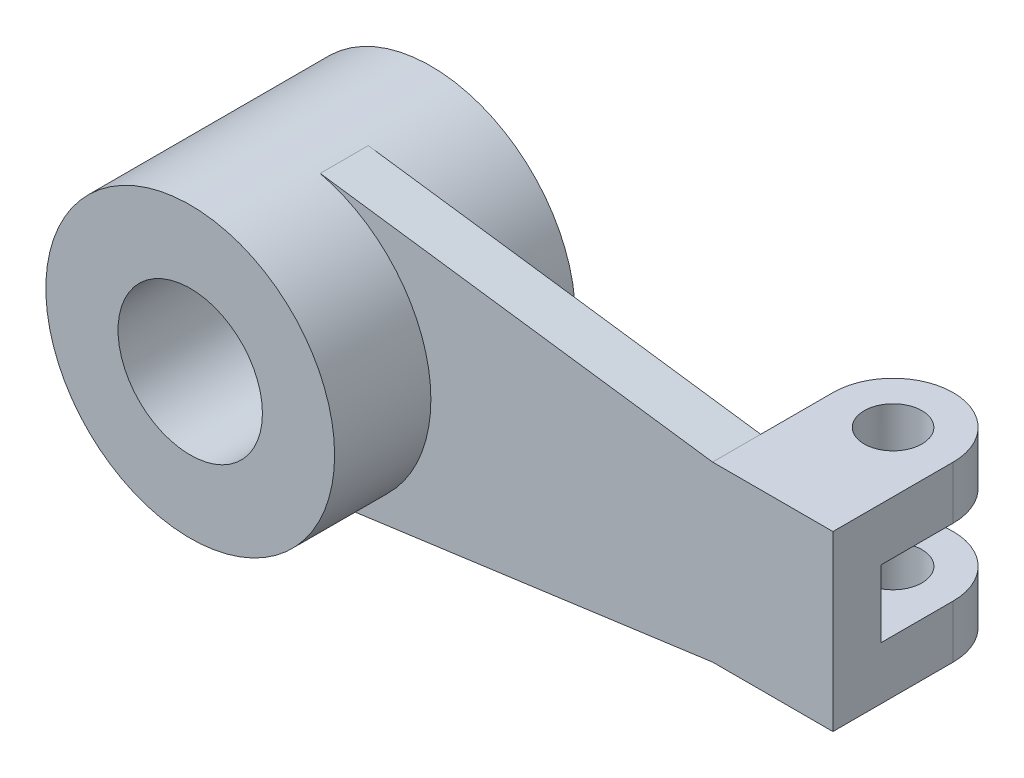
ISO-10303-21;
HEADER;
FILE_DESCRIPTION(('STEP AP214'),'2;1');
FILE_NAME('part.step','',(''),(''),'','','');
FILE_SCHEMA(('AUTOMOTIVE_DESIGN { 1 0 10303 214 1 1 1 1 }'));
ENDSEC;
DATA;
#1=APPLICATION_CONTEXT('core data for automotive mechanical design processes');
#2=APPLICATION_PROTOCOL_DEFINITION('international standard','automotive_design',2000,#1);
#3=PRODUCT_CONTEXT('',#1,'mechanical');
#4=PRODUCT('Part','Part','',(#3));
#5=PRODUCT_RELATED_PRODUCT_CATEGORY('part','',(#4));
#6=PRODUCT_DEFINITION_FORMATION('','',#4);
#7=PRODUCT_DEFINITION_CONTEXT('part definition',#1,'design');
#8=PRODUCT_DEFINITION('design','',#6,#7);
#9=PRODUCT_DEFINITION_SHAPE('','',#8);
#10=(LENGTH_UNIT() NAMED_UNIT(*) SI_UNIT(.MILLI.,.METRE.));
#11=(NAMED_UNIT(*) PLANE_ANGLE_UNIT() SI_UNIT($,.RADIAN.));
#12=(NAMED_UNIT(*) SI_UNIT($,.STERADIAN.) SOLID_ANGLE_UNIT());
#13=UNCERTAINTY_MEASURE_WITH_UNIT(LENGTH_MEASURE(1.E-05),#10,'distance_accuracy_value','');
#14=(GEOMETRIC_REPRESENTATION_CONTEXT(3) GLOBAL_UNCERTAINTY_ASSIGNED_CONTEXT((#13)) GLOBAL_UNIT_ASSIGNED_CONTEXT((#10,
#11,#12)) REPRESENTATION_CONTEXT('',''));
#15=CARTESIAN_POINT('',(0.,0.,0.));
#16=DIRECTION('',(0.,0.,1.));
#17=DIRECTION('',(1.,0.,0.));
#18=AXIS2_PLACEMENT_3D('',#15,#16,#17);
#19=CARTESIAN_POINT('',(113.53373760739,0.,5.));
#20=DIRECTION('',(-1.,0.,0.));
#21=DIRECTION('',(0.,0.,1.));
#22=AXIS2_PLACEMENT_3D('',#19,#20,#21);
#23=PLANE('',#22);
#24=DIRECTION('',(0.,0.,-1.));
#25=VECTOR('',#24,1.);
#26=CARTESIAN_POINT('',(113.53373760739,7.,0.));
#27=LINE('',#26,#25);
#28=CARTESIAN_POINT('',(113.53373760739,7.,-5.));
#29=VERTEX_POINT('',#28);
#30=CARTESIAN_POINT('',(113.53373760739,7.,-20.));
#31=VERTEX_POINT('',#30);
#32=EDGE_CURVE('E125',#29,#31,#27,.T.);
#33=ORIENTED_EDGE('',*,*,#32,.T.);
#34=DIRECTION('',(0.,1.,0.));
#35=VECTOR('',#34,1.);
#36=CARTESIAN_POINT('',(113.53373760739,-18.0000000000001,-20.));
#37=LINE('',#36,#35);
#38=CARTESIAN_POINT('',(113.53373760739,18.,-20.));
#39=VERTEX_POINT('',#38);
#40=EDGE_CURVE('E172',#31,#39,#37,.T.);
#41=ORIENTED_EDGE('',*,*,#40,.T.);
#42=DIRECTION('',(0.,0.,-1.));
#43=VECTOR('',#42,1.);
#44=CARTESIAN_POINT('',(113.53373760739,18.,5.));
#45=LINE('',#44,#43);
#46=CARTESIAN_POINT('',(113.53373760739,18.,5.));
#47=VERTEX_POINT('',#46);
#48=EDGE_CURVE('E210',#47,#39,#45,.T.);
#49=ORIENTED_EDGE('',*,*,#48,.F.);
#50=DIRECTION('',(0.,1.,0.));
#51=VECTOR('',#50,1.);
#52=CARTESIAN_POINT('',(113.53373760739,0.,5.));
#53=LINE('',#52,#51);
#54=CARTESIAN_POINT('',(113.53373760739,-18.,5.));
#55=VERTEX_POINT('',#54);
#56=EDGE_CURVE('E179',#55,#47,#53,.T.);
#57=ORIENTED_EDGE('',*,*,#56,.F.);
#58=DIRECTION('',(0.,0.,-1.));
#59=VECTOR('',#58,1.);
#60=CARTESIAN_POINT('',(113.53373760739,-18.,5.));
#61=LINE('',#60,#59);
#62=CARTESIAN_POINT('',(113.53373760739,-18.0000000000001,-20.));
#63=VERTEX_POINT('',#62);
#64=EDGE_CURVE('E191',#55,#63,#61,.T.);
#65=ORIENTED_EDGE('',*,*,#64,.T.);
#66=CARTESIAN_POINT('',(113.53373760739,-7.,-20.));
#67=VERTEX_POINT('',#66);
#68=EDGE_CURVE('E137',#63,#67,#37,.T.);
#69=ORIENTED_EDGE('',*,*,#68,.T.);
#70=DIRECTION('',(0.,0.,-1.));
#71=VECTOR('',#70,1.);
#72=CARTESIAN_POINT('',(113.53373760739,-7.,0.));
#73=LINE('',#72,#71);
#74=CARTESIAN_POINT('',(113.53373760739,-7.,-5.));
#75=VERTEX_POINT('',#74);
#76=EDGE_CURVE('E120',#75,#67,#73,.T.);
#77=ORIENTED_EDGE('',*,*,#76,.F.);
#78=DIRECTION('',(0.,-1.,0.));
#79=VECTOR('',#78,1.);
#80=CARTESIAN_POINT('',(113.53373760739,0.,-5.));
#81=LINE('',#80,#79);
#82=EDGE_CURVE('E128',#29,#75,#81,.T.);
#83=ORIENTED_EDGE('',*,*,#82,.F.);
#84=EDGE_LOOP('',(#33,#41,#49,#57,#65,#69,#77,#83));
#85=FACE_BOUND('',#84,.T.);
#86=ADVANCED_FACE('F35',(#85),#23,.F.);
#87=CARTESIAN_POINT('',(101.03373760739,-18.0000000000001,-20.));
#88=DIRECTION('',(0.,1.,0.));
#89=DIRECTION('',(-1.,0.,0.));
#90=AXIS2_PLACEMENT_3D('',#87,#88,#89);
#91=CYLINDRICAL_SURFACE('',#90,12.5);
#92=ORIENTED_EDGE('',*,*,#40,.F.);
#93=CARTESIAN_POINT('',(101.03373760739,7.,-20.));
#94=DIRECTION('',(0.,-1.,0.));
#95=DIRECTION('',(0.,0.,-1.));
#96=AXIS2_PLACEMENT_3D('',#93,#94,#95);
#97=CIRCLE('',#96,12.5);
#98=CARTESIAN_POINT('',(88.5337376073903,7.,-20.));
#99=VERTEX_POINT('',#98);
#100=EDGE_CURVE('E146',#31,#99,#97,.F.);
#101=ORIENTED_EDGE('',*,*,#100,.T.);
#102=DIRECTION('',(0.,1.,0.));
#103=VECTOR('',#102,1.);
#104=CARTESIAN_POINT('',(88.5337376073903,-18.0000000000001,-20.));
#105=LINE('',#104,#103);
#106=CARTESIAN_POINT('',(88.5337376073903,18.,-20.));
#107=VERTEX_POINT('',#106);
#108=EDGE_CURVE('E162',#99,#107,#105,.T.);
#109=ORIENTED_EDGE('',*,*,#108,.T.);
#110=CARTESIAN_POINT('',(101.03373760739,18.,-20.));
#111=DIRECTION('',(0.,1.,0.));
#112=DIRECTION('',(-1.,0.,0.));
#113=AXIS2_PLACEMENT_3D('',#110,#111,#112);
#114=CIRCLE('',#113,12.5);
#115=EDGE_CURVE('E165',#39,#107,#114,.T.);
#116=ORIENTED_EDGE('',*,*,#115,.F.);
#117=EDGE_LOOP('',(#92,#101,#109,#116));
#118=FACE_BOUND('',#117,.T.);
#119=ADVANCED_FACE('F264',(#118),#91,.T.);
#120=CARTESIAN_POINT('',(101.03373760739,-18.0000000000001,-20.));
#121=DIRECTION('',(0.,1.,0.));
#122=DIRECTION('',(-1.,0.,0.));
#123=AXIS2_PLACEMENT_3D('',#120,#121,#122);
#124=CYLINDRICAL_SURFACE('',#123,6.);
#125=CARTESIAN_POINT('',(101.03373760739,18.,-20.));
#126=DIRECTION('',(0.,1.,0.));
#127=DIRECTION('',(-1.,0.,0.));
#128=AXIS2_PLACEMENT_3D('',#125,#126,#127);
#129=CIRCLE('',#128,6.);
#130=CARTESIAN_POINT('',(95.0337376073903,18.,-20.));
#131=VERTEX_POINT('',#130);
#132=EDGE_CURVE('E152',#131,#131,#129,.T.);
#133=ORIENTED_EDGE('',*,*,#132,.T.);
#134=EDGE_LOOP('',(#133));
#135=FACE_BOUND('',#134,.T.);
#136=CARTESIAN_POINT('',(101.03373760739,7.,-20.));
#137=DIRECTION('',(0.,-1.,0.));
#138=DIRECTION('',(0.,0.,-1.));
#139=AXIS2_PLACEMENT_3D('',#136,#137,#138);
#140=CIRCLE('',#139,6.);
#141=CARTESIAN_POINT('',(101.03373760739,7.,-26.));
#142=VERTEX_POINT('',#141);
#143=EDGE_CURVE('E149',#142,#142,#140,.F.);
#144=ORIENTED_EDGE('',*,*,#143,.F.);
#145=EDGE_LOOP('',(#144));
#146=FACE_BOUND('',#145,.T.);
#147=ADVANCED_FACE('F272',(#135,#146),#124,.F.);
#148=CARTESIAN_POINT('',(88.5337376073903,-18.0000000000001,0.));
#149=DIRECTION('',(1.,0.,0.));
#150=DIRECTION('',(0.,1.,0.));
#151=AXIS2_PLACEMENT_3D('',#148,#149,#150);
#152=PLANE('',#151);
#153=DIRECTION('',(0.,0.,-1.));
#154=VECTOR('',#153,1.);
#155=CARTESIAN_POINT('',(88.5337376073903,7.,0.));
#156=LINE('',#155,#154);
#157=CARTESIAN_POINT('',(88.5337376073903,7.,-5.));
#158=VERTEX_POINT('',#157);
#159=EDGE_CURVE('E11',#158,#99,#156,.T.);
#160=ORIENTED_EDGE('',*,*,#159,.F.);
#161=DIRECTION('',(0.,1.,0.));
#162=VECTOR('',#161,1.);
#163=CARTESIAN_POINT('',(88.5337376073903,-18.0000000000001,-5.));
#164=LINE('',#163,#162);
#165=CARTESIAN_POINT('',(88.5337376073903,18.,-5.));
#166=VERTEX_POINT('',#165);
#167=EDGE_CURVE('E175',#158,#166,#164,.T.);
#168=ORIENTED_EDGE('',*,*,#167,.T.);
#169=DIRECTION('',(0.,0.,-1.));
#170=VECTOR('',#169,1.);
#171=CARTESIAN_POINT('',(88.5337376073903,18.,0.));
#172=LINE('',#171,#170);
#173=EDGE_CURVE('E157',#166,#107,#172,.T.);
#174=ORIENTED_EDGE('',*,*,#173,.T.);
#175=ORIENTED_EDGE('',*,*,#108,.F.);
#176=EDGE_LOOP('',(#160,#168,#174,#175));
#177=FACE_BOUND('',#176,.T.);
#178=ADVANCED_FACE('F255',(#177),#152,.F.);
#179=CARTESIAN_POINT('',(0.,0.,-5.));
#180=DIRECTION('',(0.,0.,1.));
#181=DIRECTION('',(1.,0.,0.));
#182=AXIS2_PLACEMENT_3D('',#179,#180,#181);
#183=PLANE('',#182);
#184=ORIENTED_EDGE('',*,*,#167,.F.);
#185=DIRECTION('',(1.,0.,0.));
#186=VECTOR('',#185,1.);
#187=CARTESIAN_POINT('',(77.5337376073902,7.,-5.));
#188=LINE('',#187,#186);
#189=EDGE_CURVE('E124',#158,#29,#188,.T.);
#190=ORIENTED_EDGE('',*,*,#189,.T.);
#191=ORIENTED_EDGE('',*,*,#82,.T.);
#192=DIRECTION('',(1.,0.,0.));
#193=VECTOR('',#192,1.);
#194=CARTESIAN_POINT('',(77.5337376073902,-7.,-5.));
#195=LINE('',#194,#193);
#196=CARTESIAN_POINT('',(88.5337376073903,-7.,-5.));
#197=VERTEX_POINT('',#196);
#198=EDGE_CURVE('E115',#197,#75,#195,.T.);
#199=ORIENTED_EDGE('',*,*,#198,.F.);
#200=CARTESIAN_POINT('',(88.5337376073903,-18.0000000000001,-5.));
#201=VERTEX_POINT('',#200);
#202=EDGE_CURVE('E173',#201,#197,#164,.T.);
#203=ORIENTED_EDGE('',*,*,#202,.F.);
#204=DIRECTION('',(0.99080287432188,0.135313207912241,0.));
#205=VECTOR('',#204,1.);
#206=CARTESIAN_POINT('',(88.5337376073903,-18.,-5.));
#207=LINE('',#206,#205);
#208=CARTESIAN_POINT('',(7.33697085478256,-29.0889817401034,-5.));
#209=VERTEX_POINT('',#208);
#210=EDGE_CURVE('E182',#209,#201,#207,.T.);
#211=ORIENTED_EDGE('',*,*,#210,.F.);
#212=CARTESIAN_POINT('',(0.,0.,-5.));
#213=DIRECTION('',(0.,0.,-1.));
#214=DIRECTION('',(1.,0.,0.));
#215=AXIS2_PLACEMENT_3D('',#212,#213,#214);
#216=CIRCLE('',#215,30.);
#217=CARTESIAN_POINT('',(6.99558977419302,29.1729622032321,-5.));
#218=VERTEX_POINT('',#217);
#219=EDGE_CURVE('E194',#218,#209,#216,.T.);
#220=ORIENTED_EDGE('',*,*,#219,.F.);
#221=DIRECTION('',(-0.99074191658666,0.135758810830795,0.));
#222=VECTOR('',#221,1.);
#223=CARTESIAN_POINT('',(88.5337376073903,18.,-5.));
#224=LINE('',#223,#222);
#225=EDGE_CURVE('E171',#166,#218,#224,.T.);
#226=ORIENTED_EDGE('',*,*,#225,.F.);
#227=EDGE_LOOP('',(#184,#190,#191,#199,#203,#211,#220,#226));
#228=FACE_BOUND('',#227,.T.);
#229=ADVANCED_FACE('F130',(#228),#183,.F.);
#230=CARTESIAN_POINT('',(0.,0.,25.));
#231=DIRECTION('',(0.,0.,1.));
#232=DIRECTION('',(1.,0.,0.));
#233=AXIS2_PLACEMENT_3D('',#230,#231,#232);
#234=PLANE('',#233);
#235=CARTESIAN_POINT('',(0.,0.,25.));
#236=DIRECTION('',(0.,0.,1.));
#237=DIRECTION('',(1.,0.,0.));
#238=AXIS2_PLACEMENT_3D('',#235,#236,#237);
#239=CIRCLE('',#238,30.);
#240=CARTESIAN_POINT('',(30.,0.,25.));
#241=VERTEX_POINT('',#240);
#242=EDGE_CURVE('E220',#241,#241,#239,.T.);
#243=ORIENTED_EDGE('',*,*,#242,.T.);
#244=EDGE_LOOP('',(#243));
#245=FACE_BOUND('',#244,.T.);
#246=CARTESIAN_POINT('',(0.,0.,25.));
#247=DIRECTION('',(0.,0.,1.));
#248=DIRECTION('',(1.,0.,0.));
#249=AXIS2_PLACEMENT_3D('',#246,#247,#248);
#250=CIRCLE('',#249,15.);
#251=CARTESIAN_POINT('',(15.,0.,25.));
#252=VERTEX_POINT('',#251);
#253=EDGE_CURVE('E214',#252,#252,#250,.T.);
#254=ORIENTED_EDGE('',*,*,#253,.F.);
#255=EDGE_LOOP('',(#254));
#256=FACE_BOUND('',#255,.T.);
#257=ADVANCED_FACE('F297',(#245,#256),#234,.T.);
#258=CARTESIAN_POINT('',(0.,0.,-25.));
#259=DIRECTION('',(0.,0.,1.));
#260=DIRECTION('',(1.,0.,0.));
#261=AXIS2_PLACEMENT_3D('',#258,#259,#260);
#262=PLANE('',#261);
#263=CARTESIAN_POINT('',(0.,0.,-25.));
#264=DIRECTION('',(0.,0.,1.));
#265=DIRECTION('',(1.,0.,0.));
#266=AXIS2_PLACEMENT_3D('',#263,#264,#265);
#267=CIRCLE('',#266,30.);
#268=CARTESIAN_POINT('',(30.,0.,-25.));
#269=VERTEX_POINT('',#268);
#270=EDGE_CURVE('E217',#269,#269,#267,.T.);
#271=ORIENTED_EDGE('',*,*,#270,.F.);
#272=EDGE_LOOP('',(#271));
#273=FACE_BOUND('',#272,.T.);
#274=CARTESIAN_POINT('',(0.,0.,-25.));
#275=DIRECTION('',(0.,0.,1.));
#276=DIRECTION('',(1.,0.,0.));
#277=AXIS2_PLACEMENT_3D('',#274,#275,#276);
#278=CIRCLE('',#277,15.);
#279=CARTESIAN_POINT('',(15.,0.,-25.));
#280=VERTEX_POINT('',#279);
#281=EDGE_CURVE('E213',#280,#280,#278,.T.);
#282=ORIENTED_EDGE('',*,*,#281,.T.);
#283=EDGE_LOOP('',(#282));
#284=FACE_BOUND('',#283,.T.);
#285=ADVANCED_FACE('F299',(#273,#284),#262,.F.);
#286=CARTESIAN_POINT('',(0.,0.,25.));
#287=DIRECTION('',(0.,0.,-1.));
#288=DIRECTION('',(-1.,0.,0.));
#289=AXIS2_PLACEMENT_3D('',#286,#287,#288);
#290=CYLINDRICAL_SURFACE('',#289,30.);
#291=DIRECTION('',(0.,0.,-1.));
#292=VECTOR('',#291,1.);
#293=CARTESIAN_POINT('',(7.33697085478253,-29.0889817401034,5.));
#294=LINE('',#293,#292);
#295=CARTESIAN_POINT('',(7.3369708547825,-29.0889817401035,5.));
#296=VERTEX_POINT('',#295);
#297=EDGE_CURVE('E202',#296,#209,#294,.T.);
#298=ORIENTED_EDGE('',*,*,#297,.F.);
#299=CARTESIAN_POINT('',(0.,0.,5.));
#300=DIRECTION('',(0.,0.,-1.));
#301=DIRECTION('',(1.,0.,0.));
#302=AXIS2_PLACEMENT_3D('',#299,#300,#301);
#303=CIRCLE('',#302,30.);
#304=CARTESIAN_POINT('',(6.99558977419301,29.1729622032321,5.));
#305=VERTEX_POINT('',#304);
#306=EDGE_CURVE('E58',#305,#296,#303,.T.);
#307=ORIENTED_EDGE('',*,*,#306,.F.);
#308=DIRECTION('',(0.,0.,-1.));
#309=VECTOR('',#308,1.);
#310=CARTESIAN_POINT('',(6.99558977419302,29.1729622032321,5.));
#311=LINE('',#310,#309);
#312=EDGE_CURVE('E205',#305,#218,#311,.T.);
#313=ORIENTED_EDGE('',*,*,#312,.T.);
#314=ORIENTED_EDGE('',*,*,#219,.T.);
#315=EDGE_LOOP('',(#298,#307,#313,#314));
#316=FACE_BOUND('',#315,.T.);
#317=ORIENTED_EDGE('',*,*,#242,.F.);
#318=EDGE_LOOP('',(#317));
#319=FACE_BOUND('',#318,.T.);
#320=ORIENTED_EDGE('',*,*,#270,.T.);
#321=EDGE_LOOP('',(#320));
#322=FACE_BOUND('',#321,.T.);
#323=ADVANCED_FACE('F37',(#316,#319,#322),#290,.T.);
#324=CARTESIAN_POINT('',(0.,0.,25.));
#325=DIRECTION('',(0.,0.,-1.));
#326=DIRECTION('',(-1.,0.,0.));
#327=AXIS2_PLACEMENT_3D('',#324,#325,#326);
#328=CYLINDRICAL_SURFACE('',#327,15.);
#329=ORIENTED_EDGE('',*,*,#253,.T.);
#330=EDGE_LOOP('',(#329));
#331=FACE_BOUND('',#330,.T.);
#332=ORIENTED_EDGE('',*,*,#281,.F.);
#333=EDGE_LOOP('',(#332));
#334=FACE_BOUND('',#333,.T.);
#335=ADVANCED_FACE('F293',(#331,#334),#328,.F.);
#336=CARTESIAN_POINT('',(113.53373760739,18.,5.));
#337=DIRECTION('',(0.,-1.,0.));
#338=DIRECTION('',(1.,0.,0.));
#339=AXIS2_PLACEMENT_3D('',#336,#337,#338);
#340=PLANE('',#339);
#341=ORIENTED_EDGE('',*,*,#48,.T.);
#342=ORIENTED_EDGE('',*,*,#115,.T.);
#343=ORIENTED_EDGE('',*,*,#173,.F.);
#344=DIRECTION('',(0.,0.,-1.));
#345=VECTOR('',#344,1.);
#346=CARTESIAN_POINT('',(88.5337376073903,18.,5.));
#347=LINE('',#346,#345);
#348=CARTESIAN_POINT('',(88.5337376073903,18.,5.));
#349=VERTEX_POINT('',#348);
#350=EDGE_CURVE('E207',#349,#166,#347,.T.);
#351=ORIENTED_EDGE('',*,*,#350,.F.);
#352=DIRECTION('',(-1.,0.,0.));
#353=VECTOR('',#352,1.);
#354=CARTESIAN_POINT('',(113.53373760739,18.,5.));
#355=LINE('',#354,#353);
#356=EDGE_CURVE('E181',#47,#349,#355,.T.);
#357=ORIENTED_EDGE('',*,*,#356,.F.);
#358=EDGE_LOOP('',(#341,#342,#343,#351,#357));
#359=FACE_BOUND('',#358,.T.);
#360=ORIENTED_EDGE('',*,*,#132,.F.);
#361=EDGE_LOOP('',(#360));
#362=FACE_BOUND('',#361,.T.);
#363=ADVANCED_FACE('F258',(#359,#362),#340,.F.);
#364=CARTESIAN_POINT('',(88.5337376073903,18.,5.));
#365=DIRECTION('',(-0.135758810830795,-0.99074191658666,0.));
#366=DIRECTION('',(0.99074191658666,-0.135758810830795,0.));
#367=AXIS2_PLACEMENT_3D('',#364,#365,#366);
#368=PLANE('',#367);
#369=ORIENTED_EDGE('',*,*,#225,.T.);
#370=ORIENTED_EDGE('',*,*,#312,.F.);
#371=DIRECTION('',(-0.99074191658666,0.135758810830795,0.));
#372=VECTOR('',#371,1.);
#373=CARTESIAN_POINT('',(88.5337376073903,18.,5.));
#374=LINE('',#373,#372);
#375=EDGE_CURVE('E184',#349,#305,#374,.T.);
#376=ORIENTED_EDGE('',*,*,#375,.F.);
#377=ORIENTED_EDGE('',*,*,#350,.T.);
#378=EDGE_LOOP('',(#369,#370,#376,#377));
#379=FACE_BOUND('',#378,.T.);
#380=ADVANCED_FACE('F250',(#379),#368,.F.);
#381=CARTESIAN_POINT('',(88.5337376073903,-18.,5.));
#382=DIRECTION('',(-0.135313207912241,0.99080287432188,0.));
#383=DIRECTION('',(-0.99080287432188,-0.135313207912241,0.));
#384=AXIS2_PLACEMENT_3D('',#381,#382,#383);
#385=PLANE('',#384);
#386=ORIENTED_EDGE('',*,*,#210,.T.);
#387=DIRECTION('',(0.,0.,-1.));
#388=VECTOR('',#387,1.);
#389=CARTESIAN_POINT('',(88.5337376073903,-18.,5.));
#390=LINE('',#389,#388);
#391=CARTESIAN_POINT('',(88.5337376073903,-18.,5.));
#392=VERTEX_POINT('',#391);
#393=EDGE_CURVE('E199',#392,#201,#390,.T.);
#394=ORIENTED_EDGE('',*,*,#393,.F.);
#395=DIRECTION('',(0.99080287432188,0.135313207912241,0.));
#396=VECTOR('',#395,1.);
#397=CARTESIAN_POINT('',(88.5337376073903,-18.,5.));
#398=LINE('',#397,#396);
#399=EDGE_CURVE('E187',#296,#392,#398,.T.);
#400=ORIENTED_EDGE('',*,*,#399,.F.);
#401=ORIENTED_EDGE('',*,*,#297,.T.);
#402=EDGE_LOOP('',(#386,#394,#400,#401));
#403=FACE_BOUND('',#402,.T.);
#404=ADVANCED_FACE('F240',(#403),#385,.F.);
#405=CARTESIAN_POINT('',(113.53373760739,-18.,5.));
#406=DIRECTION('',(0.,1.,0.));
#407=DIRECTION('',(-1.,0.,0.));
#408=AXIS2_PLACEMENT_3D('',#405,#406,#407);
#409=PLANE('',#408);
#410=ORIENTED_EDGE('',*,*,#393,.T.);
#411=DIRECTION('',(0.,0.,-1.));
#412=VECTOR('',#411,1.);
#413=CARTESIAN_POINT('',(88.5337376073903,-18.0000000000001,0.));
#414=LINE('',#413,#412);
#415=CARTESIAN_POINT('',(88.5337376073903,-18.0000000000001,-20.));
#416=VERTEX_POINT('',#415);
#417=EDGE_CURVE('E160',#201,#416,#414,.T.);
#418=ORIENTED_EDGE('',*,*,#417,.T.);
#419=CARTESIAN_POINT('',(101.03373760739,-18.0000000000001,-20.));
#420=DIRECTION('',(0.,1.,0.));
#421=DIRECTION('',(-1.,0.,0.));
#422=AXIS2_PLACEMENT_3D('',#419,#420,#421);
#423=CIRCLE('',#422,12.5);
#424=EDGE_CURVE('E156',#63,#416,#423,.T.);
#425=ORIENTED_EDGE('',*,*,#424,.F.);
#426=ORIENTED_EDGE('',*,*,#64,.F.);
#427=DIRECTION('',(1.,0.,0.));
#428=VECTOR('',#427,1.);
#429=CARTESIAN_POINT('',(113.53373760739,-18.,5.));
#430=LINE('',#429,#428);
#431=EDGE_CURVE('E189',#392,#55,#430,.T.);
#432=ORIENTED_EDGE('',*,*,#431,.F.);
#433=EDGE_LOOP('',(#410,#418,#425,#426,#432));
#434=FACE_BOUND('',#433,.T.);
#435=CARTESIAN_POINT('',(101.03373760739,-18.0000000000001,-20.));
#436=DIRECTION('',(0.,1.,0.));
#437=DIRECTION('',(-1.,0.,0.));
#438=AXIS2_PLACEMENT_3D('',#435,#436,#437);
#439=CIRCLE('',#438,6.);
#440=CARTESIAN_POINT('',(95.0337376073903,-18.0000000000001,-20.));
#441=VERTEX_POINT('',#440);
#442=EDGE_CURVE('E153',#441,#441,#439,.T.);
#443=ORIENTED_EDGE('',*,*,#442,.T.);
#444=EDGE_LOOP('',(#443));
#445=FACE_BOUND('',#444,.T.);
#446=ADVANCED_FACE('F232',(#434,#445),#409,.F.);
#447=CARTESIAN_POINT('',(0.,0.,5.));
#448=DIRECTION('',(0.,0.,1.));
#449=DIRECTION('',(1.,0.,0.));
#450=AXIS2_PLACEMENT_3D('',#447,#448,#449);
#451=PLANE('',#450);
#452=ORIENTED_EDGE('',*,*,#56,.T.);
#453=ORIENTED_EDGE('',*,*,#356,.T.);
#454=ORIENTED_EDGE('',*,*,#375,.T.);
#455=ORIENTED_EDGE('',*,*,#306,.T.);
#456=ORIENTED_EDGE('',*,*,#399,.T.);
#457=ORIENTED_EDGE('',*,*,#431,.T.);
#458=EDGE_LOOP('',(#452,#453,#454,#455,#456,#457));
#459=FACE_BOUND('',#458,.T.);
#460=ADVANCED_FACE('F244',(#459),#451,.T.);
#461=CARTESIAN_POINT('',(101.03373760739,-7.,-20.));
#462=DIRECTION('',(0.,-1.,0.));
#463=DIRECTION('',(0.,0.,-1.));
#464=AXIS2_PLACEMENT_3D('',#461,#462,#463);
#465=CIRCLE('',#464,12.5);
#466=CARTESIAN_POINT('',(88.5337376073903,-7.,-20.));
#467=VERTEX_POINT('',#466);
#468=EDGE_CURVE('E50',#67,#467,#465,.F.);
#469=ORIENTED_EDGE('',*,*,#468,.F.);
#470=ORIENTED_EDGE('',*,*,#68,.F.);
#471=ORIENTED_EDGE('',*,*,#424,.T.);
#472=EDGE_CURVE('E176',#416,#467,#105,.T.);
#473=ORIENTED_EDGE('',*,*,#472,.T.);
#474=EDGE_LOOP('',(#469,#470,#471,#473));
#475=FACE_BOUND('',#474,.T.);
#476=ADVANCED_FACE('F228',(#475),#91,.T.);
#477=CARTESIAN_POINT('',(101.03373760739,-7.,-20.));
#478=DIRECTION('',(0.,-1.,0.));
#479=DIRECTION('',(0.,0.,-1.));
#480=AXIS2_PLACEMENT_3D('',#477,#478,#479);
#481=CIRCLE('',#480,6.);
#482=CARTESIAN_POINT('',(101.03373760739,-7.,-26.));
#483=VERTEX_POINT('',#482);
#484=EDGE_CURVE('E143',#483,#483,#481,.F.);
#485=ORIENTED_EDGE('',*,*,#484,.T.);
#486=EDGE_LOOP('',(#485));
#487=FACE_BOUND('',#486,.T.);
#488=ORIENTED_EDGE('',*,*,#442,.F.);
#489=EDGE_LOOP('',(#488));
#490=FACE_BOUND('',#489,.T.);
#491=ADVANCED_FACE('F276',(#487,#490),#124,.F.);
#492=ORIENTED_EDGE('',*,*,#202,.T.);
#493=DIRECTION('',(0.,0.,-1.));
#494=VECTOR('',#493,1.);
#495=CARTESIAN_POINT('',(88.5337376073903,-7.,0.));
#496=LINE('',#495,#494);
#497=EDGE_CURVE('E43',#197,#467,#496,.T.);
#498=ORIENTED_EDGE('',*,*,#497,.T.);
#499=ORIENTED_EDGE('',*,*,#472,.F.);
#500=ORIENTED_EDGE('',*,*,#417,.F.);
#501=EDGE_LOOP('',(#492,#498,#499,#500));
#502=FACE_BOUND('',#501,.T.);
#503=ADVANCED_FACE('F226',(#502),#152,.F.);
#504=CARTESIAN_POINT('',(77.5337376073902,7.,0.));
#505=DIRECTION('',(0.,-1.,0.));
#506=DIRECTION('',(0.,0.,-1.));
#507=AXIS2_PLACEMENT_3D('',#504,#505,#506);
#508=PLANE('',#507);
#509=ORIENTED_EDGE('',*,*,#32,.F.);
#510=ORIENTED_EDGE('',*,*,#189,.F.);
#511=ORIENTED_EDGE('',*,*,#159,.T.);
#512=ORIENTED_EDGE('',*,*,#100,.F.);
#513=EDGE_LOOP('',(#509,#510,#511,#512));
#514=FACE_BOUND('',#513,.T.);
#515=ORIENTED_EDGE('',*,*,#143,.T.);
#516=EDGE_LOOP('',(#515));
#517=FACE_BOUND('',#516,.T.);
#518=ADVANCED_FACE('F266',(#514,#517),#508,.T.);
#519=CARTESIAN_POINT('',(77.5337376073902,-7.,0.));
#520=DIRECTION('',(0.,-1.,0.));
#521=DIRECTION('',(0.,0.,-1.));
#522=AXIS2_PLACEMENT_3D('',#519,#520,#521);
#523=PLANE('',#522);
#524=ORIENTED_EDGE('',*,*,#468,.T.);
#525=ORIENTED_EDGE('',*,*,#497,.F.);
#526=ORIENTED_EDGE('',*,*,#198,.T.);
#527=ORIENTED_EDGE('',*,*,#76,.T.);
#528=EDGE_LOOP('',(#524,#525,#526,#527));
#529=FACE_BOUND('',#528,.T.);
#530=ORIENTED_EDGE('',*,*,#484,.F.);
#531=EDGE_LOOP('',(#530));
#532=FACE_BOUND('',#531,.T.);
#533=ADVANCED_FACE('F117',(#529,#532),#523,.F.);
#534=CLOSED_SHELL('',(#86,#119,#147,#178,#229,#257,#285,#323,#335,#363,#380,#404,#446,#460,#476,
#491,#503,#518,#533));
#535=MANIFOLD_SOLID_BREP('B2',#534);
#536=ADVANCED_BREP_SHAPE_REPRESENTATION('',(#18,#535),#14);
#537=SHAPE_DEFINITION_REPRESENTATION(#9,#536);
ENDSEC;
END-ISO-10303-21;
